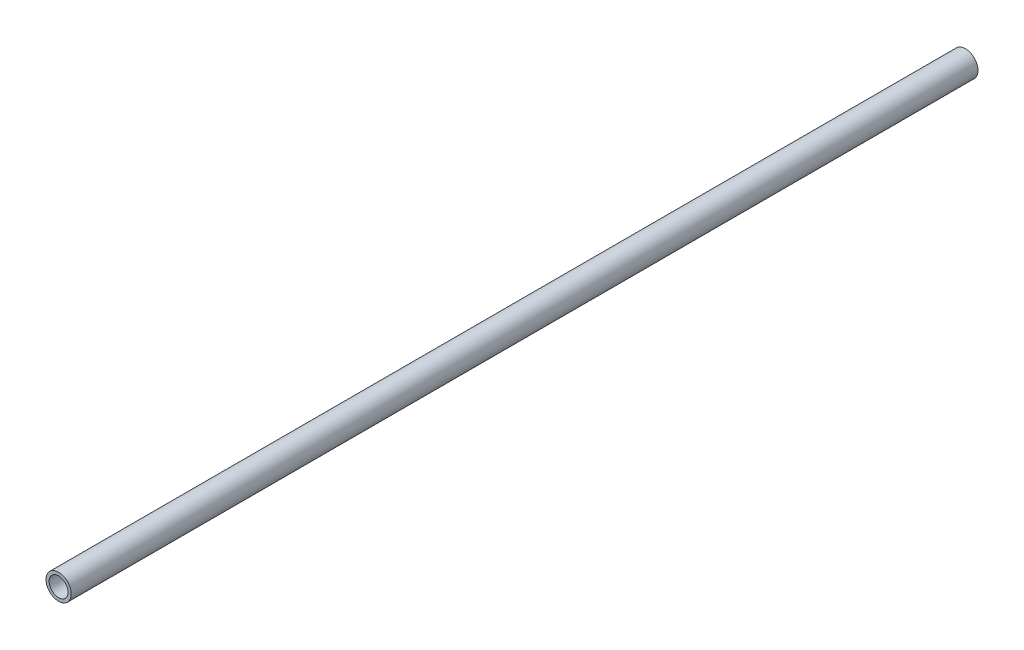
ISO-10303-21;
HEADER;
FILE_DESCRIPTION(('STEP AP214'),'2;1');
FILE_NAME('part.step','',(''),(''),'','','');
FILE_SCHEMA(('AUTOMOTIVE_DESIGN { 1 0 10303 214 1 1 1 1 }'));
ENDSEC;
DATA;
#1=APPLICATION_CONTEXT('core data for automotive mechanical design processes');
#2=APPLICATION_PROTOCOL_DEFINITION('international standard','automotive_design',2000,#1);
#3=PRODUCT_CONTEXT('',#1,'mechanical');
#4=PRODUCT('Part','Part','',(#3));
#5=PRODUCT_RELATED_PRODUCT_CATEGORY('part','',(#4));
#6=PRODUCT_DEFINITION_FORMATION('','',#4);
#7=PRODUCT_DEFINITION_CONTEXT('part definition',#1,'design');
#8=PRODUCT_DEFINITION('design','',#6,#7);
#9=PRODUCT_DEFINITION_SHAPE('','',#8);
#10=(LENGTH_UNIT() NAMED_UNIT(*) SI_UNIT(.MILLI.,.METRE.));
#11=(NAMED_UNIT(*) PLANE_ANGLE_UNIT() SI_UNIT($,.RADIAN.));
#12=(NAMED_UNIT(*) SI_UNIT($,.STERADIAN.) SOLID_ANGLE_UNIT());
#13=UNCERTAINTY_MEASURE_WITH_UNIT(LENGTH_MEASURE(1.E-05),#10,'distance_accuracy_value','');
#14=(GEOMETRIC_REPRESENTATION_CONTEXT(3) GLOBAL_UNCERTAINTY_ASSIGNED_CONTEXT((#13)) GLOBAL_UNIT_ASSIGNED_CONTEXT((#10,
#11,#12)) REPRESENTATION_CONTEXT('',''));
#15=CARTESIAN_POINT('',(0.,0.,0.));
#16=DIRECTION('',(0.,0.,1.));
#17=DIRECTION('',(1.,0.,0.));
#18=AXIS2_PLACEMENT_3D('',#15,#16,#17);
#19=CARTESIAN_POINT('',(0.,0.,575.));
#20=DIRECTION('',(0.,0.,1.));
#21=DIRECTION('',(1.,0.,0.));
#22=AXIS2_PLACEMENT_3D('',#19,#20,#21);
#23=PLANE('',#22);
#24=CARTESIAN_POINT('',(0.,0.,575.));
#25=DIRECTION('',(0.,0.,1.));
#26=DIRECTION('',(1.,0.,0.));
#27=AXIS2_PLACEMENT_3D('',#24,#25,#26);
#28=CIRCLE('',#27,8.);
#29=CARTESIAN_POINT('',(8.,0.,575.));
#30=VERTEX_POINT('',#29);
#31=EDGE_CURVE('E10',#30,#30,#28,.T.);
#32=ORIENTED_EDGE('',*,*,#31,.T.);
#33=EDGE_LOOP('',(#32));
#34=FACE_BOUND('',#33,.T.);
#35=CARTESIAN_POINT('',(0.,0.,575.));
#36=DIRECTION('',(0.,0.,1.));
#37=DIRECTION('',(1.,0.,0.));
#38=AXIS2_PLACEMENT_3D('',#35,#36,#37);
#39=CIRCLE('',#38,6.);
#40=CARTESIAN_POINT('',(6.,0.,575.));
#41=VERTEX_POINT('',#40);
#42=EDGE_CURVE('E43',#41,#41,#39,.T.);
#43=ORIENTED_EDGE('',*,*,#42,.F.);
#44=EDGE_LOOP('',(#43));
#45=FACE_BOUND('',#44,.T.);
#46=ADVANCED_FACE('F32',(#34,#45),#23,.T.);
#47=CARTESIAN_POINT('',(0.,0.,0.));
#48=DIRECTION('',(0.,0.,1.));
#49=DIRECTION('',(1.,0.,0.));
#50=AXIS2_PLACEMENT_3D('',#47,#48,#49);
#51=PLANE('',#50);
#52=CARTESIAN_POINT('',(0.,0.,0.));
#53=DIRECTION('',(0.,0.,1.));
#54=DIRECTION('',(1.,0.,0.));
#55=AXIS2_PLACEMENT_3D('',#52,#53,#54);
#56=CIRCLE('',#55,8.);
#57=CARTESIAN_POINT('',(8.,0.,0.));
#58=VERTEX_POINT('',#57);
#59=EDGE_CURVE('E36',#58,#58,#56,.T.);
#60=ORIENTED_EDGE('',*,*,#59,.F.);
#61=EDGE_LOOP('',(#60));
#62=FACE_BOUND('',#61,.T.);
#63=CARTESIAN_POINT('',(0.,0.,0.));
#64=DIRECTION('',(0.,0.,1.));
#65=DIRECTION('',(1.,0.,0.));
#66=AXIS2_PLACEMENT_3D('',#63,#64,#65);
#67=CIRCLE('',#66,6.);
#68=CARTESIAN_POINT('',(6.,0.,0.));
#69=VERTEX_POINT('',#68);
#70=EDGE_CURVE('E45',#69,#69,#67,.T.);
#71=ORIENTED_EDGE('',*,*,#70,.T.);
#72=EDGE_LOOP('',(#71));
#73=FACE_BOUND('',#72,.T.);
#74=ADVANCED_FACE('F55',(#62,#73),#51,.F.);
#75=CARTESIAN_POINT('',(0.,0.,575.));
#76=DIRECTION('',(0.,0.,-1.));
#77=DIRECTION('',(-1.,0.,0.));
#78=AXIS2_PLACEMENT_3D('',#75,#76,#77);
#79=CYLINDRICAL_SURFACE('',#78,8.);
#80=ORIENTED_EDGE('',*,*,#31,.F.);
#81=EDGE_LOOP('',(#80));
#82=FACE_BOUND('',#81,.T.);
#83=ORIENTED_EDGE('',*,*,#59,.T.);
#84=EDGE_LOOP('',(#83));
#85=FACE_BOUND('',#84,.T.);
#86=ADVANCED_FACE('F34',(#82,#85),#79,.T.);
#87=CARTESIAN_POINT('',(0.,0.,575.));
#88=DIRECTION('',(0.,0.,-1.));
#89=DIRECTION('',(-1.,0.,0.));
#90=AXIS2_PLACEMENT_3D('',#87,#88,#89);
#91=CYLINDRICAL_SURFACE('',#90,6.);
#92=ORIENTED_EDGE('',*,*,#42,.T.);
#93=EDGE_LOOP('',(#92));
#94=FACE_BOUND('',#93,.T.);
#95=ORIENTED_EDGE('',*,*,#70,.F.);
#96=EDGE_LOOP('',(#95));
#97=FACE_BOUND('',#96,.T.);
#98=ADVANCED_FACE('F51',(#94,#97),#91,.F.);
#99=CLOSED_SHELL('',(#46,#74,#86,#98));
#100=MANIFOLD_SOLID_BREP('B2',#99);
#101=ADVANCED_BREP_SHAPE_REPRESENTATION('',(#18,#100),#14);
#102=SHAPE_DEFINITION_REPRESENTATION(#9,#101);
ENDSEC;
END-ISO-10303-21;
